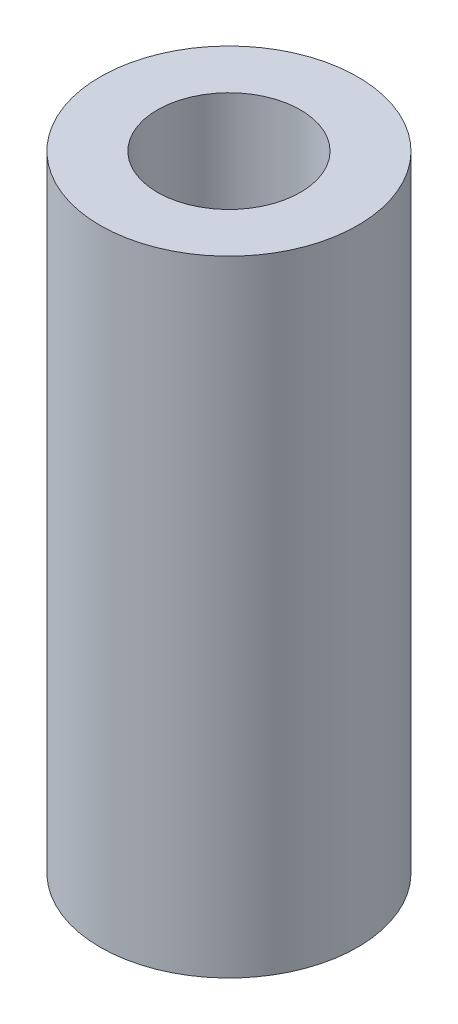
ISO-10303-21;
HEADER;
FILE_DESCRIPTION(('STEP AP214'),'2;1');
FILE_NAME('part.step','',(''),(''),'','','');
FILE_SCHEMA(('AUTOMOTIVE_DESIGN { 1 0 10303 214 1 1 1 1 }'));
ENDSEC;
DATA;
#1=APPLICATION_CONTEXT('core data for automotive mechanical design processes');
#2=APPLICATION_PROTOCOL_DEFINITION('international standard','automotive_design',2000,#1);
#3=PRODUCT_CONTEXT('',#1,'mechanical');
#4=PRODUCT('Part','Part','',(#3));
#5=PRODUCT_RELATED_PRODUCT_CATEGORY('part','',(#4));
#6=PRODUCT_DEFINITION_FORMATION('','',#4);
#7=PRODUCT_DEFINITION_CONTEXT('part definition',#1,'design');
#8=PRODUCT_DEFINITION('design','',#6,#7);
#9=PRODUCT_DEFINITION_SHAPE('','',#8);
#10=(LENGTH_UNIT() NAMED_UNIT(*) SI_UNIT(.MILLI.,.METRE.));
#11=(NAMED_UNIT(*) PLANE_ANGLE_UNIT() SI_UNIT($,.RADIAN.));
#12=(NAMED_UNIT(*) SI_UNIT($,.STERADIAN.) SOLID_ANGLE_UNIT());
#13=UNCERTAINTY_MEASURE_WITH_UNIT(LENGTH_MEASURE(1.E-05),#10,'distance_accuracy_value','');
#14=(GEOMETRIC_REPRESENTATION_CONTEXT(3) GLOBAL_UNCERTAINTY_ASSIGNED_CONTEXT((#13)) GLOBAL_UNIT_ASSIGNED_CONTEXT((#10,
#11,#12)) REPRESENTATION_CONTEXT('',''));
#15=CARTESIAN_POINT('',(0.,0.,0.));
#16=DIRECTION('',(0.,0.,1.));
#17=DIRECTION('',(1.,0.,0.));
#18=AXIS2_PLACEMENT_3D('',#15,#16,#17);
#19=CARTESIAN_POINT('',(0.,21.85,0.));
#20=DIRECTION('',(0.,1.,0.));
#21=DIRECTION('',(0.,0.,1.));
#22=AXIS2_PLACEMENT_3D('',#19,#20,#21);
#23=PLANE('',#22);
#24=CARTESIAN_POINT('',(0.,21.85,0.));
#25=DIRECTION('',(0.,1.,0.));
#26=DIRECTION('',(0.,0.,1.));
#27=AXIS2_PLACEMENT_3D('',#24,#25,#26);
#28=CIRCLE('',#27,4.5);
#29=CARTESIAN_POINT('',(0.,21.85,4.5));
#30=VERTEX_POINT('',#29);
#31=EDGE_CURVE('E10',#30,#30,#28,.T.);
#32=ORIENTED_EDGE('',*,*,#31,.T.);
#33=EDGE_LOOP('',(#32));
#34=FACE_BOUND('',#33,.T.);
#35=CARTESIAN_POINT('',(0.,21.85,0.));
#36=DIRECTION('',(0.,1.,0.));
#37=DIRECTION('',(0.,0.,1.));
#38=AXIS2_PLACEMENT_3D('',#35,#36,#37);
#39=CIRCLE('',#38,2.5);
#40=CARTESIAN_POINT('',(0.,21.85,2.5));
#41=VERTEX_POINT('',#40);
#42=EDGE_CURVE('E42',#41,#41,#39,.T.);
#43=ORIENTED_EDGE('',*,*,#42,.F.);
#44=EDGE_LOOP('',(#43));
#45=FACE_BOUND('',#44,.T.);
#46=ADVANCED_FACE('F31',(#34,#45),#23,.T.);
#47=CARTESIAN_POINT('',(0.,0.,0.));
#48=DIRECTION('',(0.,1.,0.));
#49=DIRECTION('',(0.,0.,1.));
#50=AXIS2_PLACEMENT_3D('',#47,#48,#49);
#51=PLANE('',#50);
#52=CARTESIAN_POINT('',(0.,0.,0.));
#53=DIRECTION('',(0.,1.,0.));
#54=DIRECTION('',(0.,0.,1.));
#55=AXIS2_PLACEMENT_3D('',#52,#53,#54);
#56=CIRCLE('',#55,4.5);
#57=CARTESIAN_POINT('',(0.,0.,4.5));
#58=VERTEX_POINT('',#57);
#59=EDGE_CURVE('E35',#58,#58,#56,.T.);
#60=ORIENTED_EDGE('',*,*,#59,.F.);
#61=EDGE_LOOP('',(#60));
#62=FACE_BOUND('',#61,.T.);
#63=CARTESIAN_POINT('',(0.,0.,0.));
#64=DIRECTION('',(0.,1.,0.));
#65=DIRECTION('',(0.,0.,1.));
#66=AXIS2_PLACEMENT_3D('',#63,#64,#65);
#67=CIRCLE('',#66,2.5);
#68=CARTESIAN_POINT('',(0.,0.,2.5));
#69=VERTEX_POINT('',#68);
#70=EDGE_CURVE('E44',#69,#69,#67,.T.);
#71=ORIENTED_EDGE('',*,*,#70,.T.);
#72=EDGE_LOOP('',(#71));
#73=FACE_BOUND('',#72,.T.);
#74=ADVANCED_FACE('F54',(#62,#73),#51,.F.);
#75=CARTESIAN_POINT('',(0.,21.85,0.));
#76=DIRECTION('',(0.,-1.,0.));
#77=DIRECTION('',(0.,0.,-1.));
#78=AXIS2_PLACEMENT_3D('',#75,#76,#77);
#79=CYLINDRICAL_SURFACE('',#78,4.5);
#80=ORIENTED_EDGE('',*,*,#31,.F.);
#81=EDGE_LOOP('',(#80));
#82=FACE_BOUND('',#81,.T.);
#83=ORIENTED_EDGE('',*,*,#59,.T.);
#84=EDGE_LOOP('',(#83));
#85=FACE_BOUND('',#84,.T.);
#86=ADVANCED_FACE('F33',(#82,#85),#79,.T.);
#87=CARTESIAN_POINT('',(0.,21.85,0.));
#88=DIRECTION('',(0.,-1.,0.));
#89=DIRECTION('',(0.,0.,-1.));
#90=AXIS2_PLACEMENT_3D('',#87,#88,#89);
#91=CYLINDRICAL_SURFACE('',#90,2.5);
#92=ORIENTED_EDGE('',*,*,#42,.T.);
#93=EDGE_LOOP('',(#92));
#94=FACE_BOUND('',#93,.T.);
#95=ORIENTED_EDGE('',*,*,#70,.F.);
#96=EDGE_LOOP('',(#95));
#97=FACE_BOUND('',#96,.T.);
#98=ADVANCED_FACE('F50',(#94,#97),#91,.F.);
#99=CLOSED_SHELL('',(#46,#74,#86,#98));
#100=MANIFOLD_SOLID_BREP('B2',#99);
#101=ADVANCED_BREP_SHAPE_REPRESENTATION('',(#18,#100),#14);
#102=SHAPE_DEFINITION_REPRESENTATION(#9,#101);
ENDSEC;
END-ISO-10303-21;
